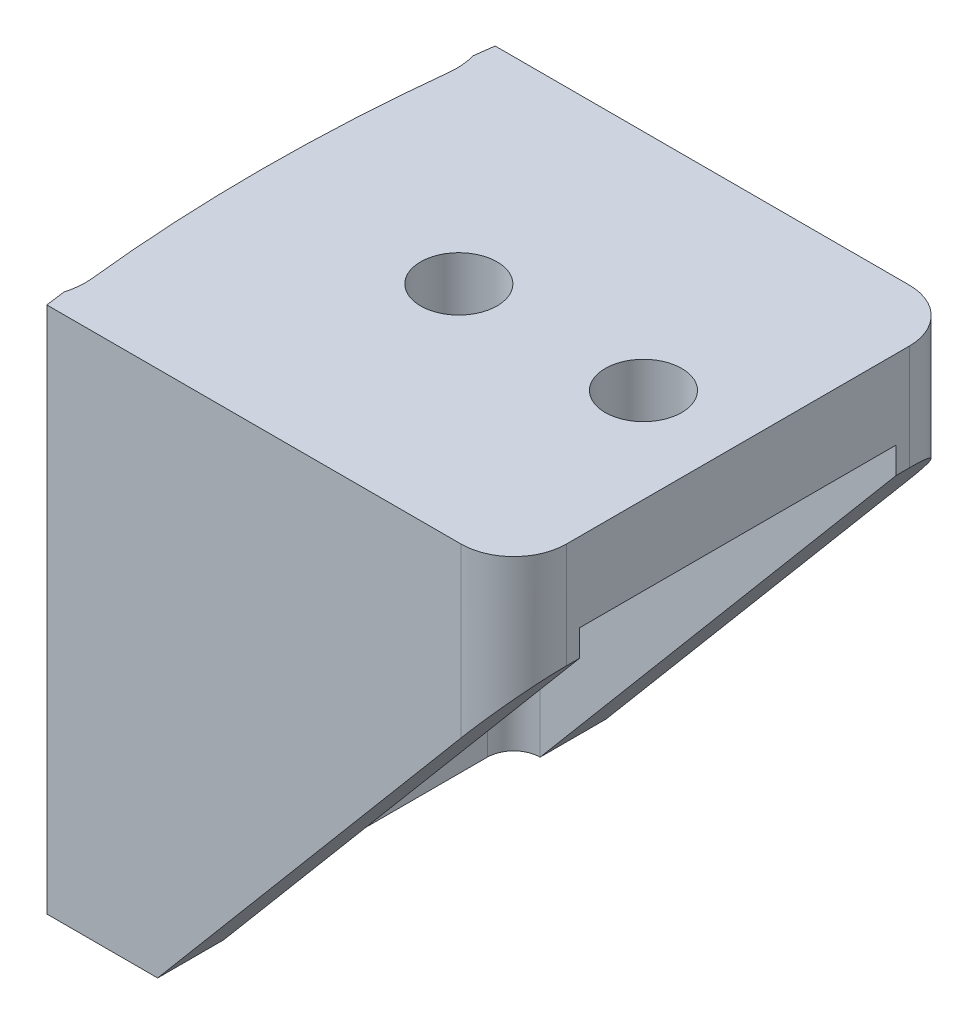
ISO-10303-21;
HEADER;
FILE_DESCRIPTION(('STEP AP214'),'2;1');
FILE_NAME('part.step','',(''),(''),'','','');
FILE_SCHEMA(('AUTOMOTIVE_DESIGN { 1 0 10303 214 1 1 1 1 }'));
ENDSEC;
DATA;
#1=APPLICATION_CONTEXT('core data for automotive mechanical design processes');
#2=APPLICATION_PROTOCOL_DEFINITION('international standard','automotive_design',2000,#1);
#3=PRODUCT_CONTEXT('',#1,'mechanical');
#4=PRODUCT('Part','Part','',(#3));
#5=PRODUCT_RELATED_PRODUCT_CATEGORY('part','',(#4));
#6=PRODUCT_DEFINITION_FORMATION('','',#4);
#7=PRODUCT_DEFINITION_CONTEXT('part definition',#1,'design');
#8=PRODUCT_DEFINITION('design','',#6,#7);
#9=PRODUCT_DEFINITION_SHAPE('','',#8);
#10=(LENGTH_UNIT() NAMED_UNIT(*) SI_UNIT(.MILLI.,.METRE.));
#11=(NAMED_UNIT(*) PLANE_ANGLE_UNIT() SI_UNIT($,.RADIAN.));
#12=(NAMED_UNIT(*) SI_UNIT($,.STERADIAN.) SOLID_ANGLE_UNIT());
#13=UNCERTAINTY_MEASURE_WITH_UNIT(LENGTH_MEASURE(1.E-05),#10,'distance_accuracy_value','');
#14=(GEOMETRIC_REPRESENTATION_CONTEXT(3) GLOBAL_UNCERTAINTY_ASSIGNED_CONTEXT((#13)) GLOBAL_UNIT_ASSIGNED_CONTEXT((#10,
#11,#12)) REPRESENTATION_CONTEXT('',''));
#15=CARTESIAN_POINT('',(0.,0.,0.));
#16=DIRECTION('',(0.,0.,1.));
#17=DIRECTION('',(1.,0.,0.));
#18=AXIS2_PLACEMENT_3D('',#15,#16,#17);
#19=CARTESIAN_POINT('',(-88.8386046433018,32.,-17.001));
#20=DIRECTION('',(-0.764291483507891,0.644870939209783,0.));
#21=DIRECTION('',(-0.644870939209783,-0.764291483507891,0.));
#22=AXIS2_PLACEMENT_3D('',#19,#20,#21);
#23=PLANE('',#22);
#24=DIRECTION('',(0.644870939209783,0.764291483507891,0.));
#25=VECTOR('',#24,1.);
#26=CARTESIAN_POINT('',(-88.8386046433018,32.,-17.));
#27=LINE('',#26,#25);
#28=CARTESIAN_POINT('',(-115.838604643302,0.,-17.));
#29=VERTEX_POINT('',#28);
#30=CARTESIAN_POINT('',(-92.8386046433018,27.2592592592593,-17.));
#31=VERTEX_POINT('',#30);
#32=EDGE_CURVE('E252',#29,#31,#27,.T.);
#33=ORIENTED_EDGE('',*,*,#32,.T.);
#34=CARTESIAN_POINT('',(-92.8386046433018,27.2592592592593,-13.));
#35=DIRECTION('',(-0.764291483507891,0.644870939209783,0.));
#36=DIRECTION('',(-0.644870939209783,-0.764291483507891,0.));
#37=AXIS2_PLACEMENT_3D('',#34,#35,#36);
#38=ELLIPSE('',#37,6.20279153050617,4.);
#39=CARTESIAN_POINT('',(-88.8386046433018,32.,-13.));
#40=VERTEX_POINT('',#39);
#41=EDGE_CURVE('E299',#31,#40,#38,.F.);
#42=ORIENTED_EDGE('',*,*,#41,.T.);
#43=DIRECTION('',(0.,0.,1.));
#44=VECTOR('',#43,1.);
#45=CARTESIAN_POINT('',(-88.8386046433018,32.,-17.001));
#46=LINE('',#45,#44);
#47=CARTESIAN_POINT('',(-88.8386046433018,32.,-12.));
#48=VERTEX_POINT('',#47);
#49=EDGE_CURVE('E228',#40,#48,#46,.T.);
#50=ORIENTED_EDGE('',*,*,#49,.T.);
#51=DIRECTION('',(-0.644870939209783,-0.764291483507891,0.));
#52=VECTOR('',#51,1.);
#53=CARTESIAN_POINT('',(-88.8386046433018,32.,-12.));
#54=LINE('',#53,#52);
#55=CARTESIAN_POINT('',(-115.838604643302,0.,-12.));
#56=VERTEX_POINT('',#55);
#57=EDGE_CURVE('E221',#48,#56,#54,.T.);
#58=ORIENTED_EDGE('',*,*,#57,.T.);
#59=DIRECTION('',(0.,0.,1.));
#60=VECTOR('',#59,1.);
#61=CARTESIAN_POINT('',(-115.838604643302,0.,-17.001));
#62=LINE('',#61,#60);
#63=EDGE_CURVE('E227',#29,#56,#62,.T.);
#64=ORIENTED_EDGE('',*,*,#63,.F.);
#65=EDGE_LOOP('',(#33,#42,#50,#58,#64));
#66=FACE_BOUND('',#65,.T.);
#67=ADVANCED_FACE('F39',(#66),#23,.F.);
#68=CARTESIAN_POINT('',(0.,40.,0.));
#69=DIRECTION('',(0.,-1.,0.));
#70=DIRECTION('',(0.,0.,-1.));
#71=AXIS2_PLACEMENT_3D('',#68,#69,#70);
#72=CYLINDRICAL_SURFACE('',#71,125.);
#73=CARTESIAN_POINT('',(0.,0.,0.));
#74=DIRECTION('',(0.,1.,0.));
#75=DIRECTION('',(0.,0.,1.));
#76=AXIS2_PLACEMENT_3D('',#73,#74,#75);
#77=CIRCLE('',#76,125.);
#78=CARTESIAN_POINT('',(-124.263961042821,0.,-13.5450354723926));
#79=VERTEX_POINT('',#78);
#80=CARTESIAN_POINT('',(-124.263961042821,0.,13.5450354723919));
#81=VERTEX_POINT('',#80);
#82=EDGE_CURVE('E258',#79,#81,#77,.T.);
#83=ORIENTED_EDGE('',*,*,#82,.T.);
#84=DIRECTION('',(0.,-1.,0.));
#85=VECTOR('',#84,1.);
#86=CARTESIAN_POINT('',(-124.263961042821,40.,13.5450354723919));
#87=LINE('',#86,#85);
#88=CARTESIAN_POINT('',(-124.263961042821,40.,13.5450354723919));
#89=VERTEX_POINT('',#88);
#90=EDGE_CURVE('E185',#81,#89,#87,.F.);
#91=ORIENTED_EDGE('',*,*,#90,.T.);
#92=CARTESIAN_POINT('',(0.,40.,0.));
#93=DIRECTION('',(0.,1.,0.));
#94=DIRECTION('',(0.,0.,1.));
#95=AXIS2_PLACEMENT_3D('',#92,#93,#94);
#96=CIRCLE('',#95,125.);
#97=CARTESIAN_POINT('',(-124.263961042821,40.,-13.5450354723926));
#98=VERTEX_POINT('',#97);
#99=EDGE_CURVE('E260',#98,#89,#96,.T.);
#100=ORIENTED_EDGE('',*,*,#99,.F.);
#101=DIRECTION('',(0.,-1.,0.));
#102=VECTOR('',#101,1.);
#103=CARTESIAN_POINT('',(-124.263961042821,40.,-13.5450354723926));
#104=LINE('',#103,#102);
#105=EDGE_CURVE('E301',#98,#79,#104,.T.);
#106=ORIENTED_EDGE('',*,*,#105,.T.);
#107=EDGE_LOOP('',(#83,#91,#100,#106));
#108=FACE_BOUND('',#107,.T.);
#109=ADVANCED_FACE('F304',(#108),#72,.T.);
#110=CARTESIAN_POINT('',(-88.8386046433018,40.,17.));
#111=DIRECTION('',(0.,0.,-1.));
#112=DIRECTION('',(-1.,0.,0.));
#113=AXIS2_PLACEMENT_3D('',#110,#111,#112);
#114=PLANE('',#113);
#115=DIRECTION('',(-0.644870939209783,-0.764291483507891,0.));
#116=VECTOR('',#115,1.);
#117=CARTESIAN_POINT('',(-88.8386046433018,32.,17.));
#118=LINE('',#117,#116);
#119=CARTESIAN_POINT('',(-92.8386046433018,27.2592592592593,17.));
#120=VERTEX_POINT('',#119);
#121=CARTESIAN_POINT('',(-115.838604643302,0.,17.));
#122=VERTEX_POINT('',#121);
#123=EDGE_CURVE('E226',#120,#122,#118,.T.);
#124=ORIENTED_EDGE('',*,*,#123,.F.);
#125=DIRECTION('',(0.,-1.,0.));
#126=VECTOR('',#125,1.);
#127=CARTESIAN_POINT('',(-92.8386046433018,40.,17.));
#128=LINE('',#127,#126);
#129=CARTESIAN_POINT('',(-92.8386046433018,40.,17.));
#130=VERTEX_POINT('',#129);
#131=EDGE_CURVE('E290',#120,#130,#128,.F.);
#132=ORIENTED_EDGE('',*,*,#131,.T.);
#133=DIRECTION('',(1.,0.,0.));
#134=VECTOR('',#133,1.);
#135=CARTESIAN_POINT('',(-88.8386046433018,40.,17.));
#136=LINE('',#135,#134);
#137=CARTESIAN_POINT('',(-124.242343828503,40.,17.));
#138=VERTEX_POINT('',#137);
#139=EDGE_CURVE('E263',#138,#130,#136,.T.);
#140=ORIENTED_EDGE('',*,*,#139,.F.);
#141=DIRECTION('',(0.,1.,0.));
#142=VECTOR('',#141,1.);
#143=CARTESIAN_POINT('',(-124.242343828503,0.,17.));
#144=LINE('',#143,#142);
#145=CARTESIAN_POINT('',(-124.242343828503,0.,17.));
#146=VERTEX_POINT('',#145);
#147=EDGE_CURVE('E169',#146,#138,#144,.T.);
#148=ORIENTED_EDGE('',*,*,#147,.F.);
#149=DIRECTION('',(1.,0.,0.));
#150=VECTOR('',#149,1.);
#151=CARTESIAN_POINT('',(-88.8386046433018,0.,17.));
#152=LINE('',#151,#150);
#153=EDGE_CURVE('E179',#146,#122,#152,.T.);
#154=ORIENTED_EDGE('',*,*,#153,.T.);
#155=EDGE_LOOP('',(#124,#132,#140,#148,#154));
#156=FACE_BOUND('',#155,.T.);
#157=ADVANCED_FACE('F342',(#156),#114,.F.);
#158=CARTESIAN_POINT('',(-88.8386046433018,40.,-17.));
#159=DIRECTION('',(-1.,0.,0.));
#160=DIRECTION('',(0.,0.,1.));
#161=AXIS2_PLACEMENT_3D('',#158,#159,#160);
#162=PLANE('',#161);
#163=DIRECTION('',(0.,0.,-1.));
#164=VECTOR('',#163,1.);
#165=CARTESIAN_POINT('',(-88.8386046433018,40.,-17.));
#166=LINE('',#165,#164);
#167=CARTESIAN_POINT('',(-88.8386046433018,40.,13.));
#168=VERTEX_POINT('',#167);
#169=CARTESIAN_POINT('',(-88.8386046433018,40.,-13.));
#170=VERTEX_POINT('',#169);
#171=EDGE_CURVE('E267',#168,#170,#166,.T.);
#172=ORIENTED_EDGE('',*,*,#171,.F.);
#173=DIRECTION('',(0.,-1.,0.));
#174=VECTOR('',#173,1.);
#175=CARTESIAN_POINT('',(-88.8386046433018,40.,13.));
#176=LINE('',#175,#174);
#177=CARTESIAN_POINT('',(-88.8386046433018,32.,13.));
#178=VERTEX_POINT('',#177);
#179=EDGE_CURVE('E285',#168,#178,#176,.T.);
#180=ORIENTED_EDGE('',*,*,#179,.T.);
#181=CARTESIAN_POINT('',(-88.8386046433018,32.,12.));
#182=VERTEX_POINT('',#181);
#183=EDGE_CURVE('E256',#182,#178,#46,.T.);
#184=ORIENTED_EDGE('',*,*,#183,.F.);
#185=DIRECTION('',(0.,-1.,0.));
#186=VECTOR('',#185,1.);
#187=CARTESIAN_POINT('',(-88.8386046433018,34.,12.));
#188=LINE('',#187,#186);
#189=CARTESIAN_POINT('',(-88.8386046433018,34.,12.));
#190=VERTEX_POINT('',#189);
#191=EDGE_CURVE('E217',#190,#182,#188,.T.);
#192=ORIENTED_EDGE('',*,*,#191,.F.);
#193=DIRECTION('',(0.,0.,1.));
#194=VECTOR('',#193,1.);
#195=CARTESIAN_POINT('',(-88.8386046433018,34.,-12.));
#196=LINE('',#195,#194);
#197=CARTESIAN_POINT('',(-88.8386046433018,34.,-12.));
#198=VERTEX_POINT('',#197);
#199=EDGE_CURVE('E243',#198,#190,#196,.T.);
#200=ORIENTED_EDGE('',*,*,#199,.F.);
#201=DIRECTION('',(0.,-1.,0.));
#202=VECTOR('',#201,1.);
#203=CARTESIAN_POINT('',(-88.8386046433018,34.,-12.));
#204=LINE('',#203,#202);
#205=EDGE_CURVE('E249',#198,#48,#204,.T.);
#206=ORIENTED_EDGE('',*,*,#205,.T.);
#207=ORIENTED_EDGE('',*,*,#49,.F.);
#208=DIRECTION('',(0.,-1.,0.));
#209=VECTOR('',#208,1.);
#210=CARTESIAN_POINT('',(-88.8386046433018,40.,-13.));
#211=LINE('',#210,#209);
#212=EDGE_CURVE('E276',#40,#170,#211,.F.);
#213=ORIENTED_EDGE('',*,*,#212,.T.);
#214=EDGE_LOOP('',(#172,#180,#184,#192,#200,#206,#207,#213));
#215=FACE_BOUND('',#214,.T.);
#216=ADVANCED_FACE('F337',(#215),#162,.F.);
#217=CARTESIAN_POINT('',(-123.838604643302,40.,-17.));
#218=DIRECTION('',(0.,0.,1.));
#219=DIRECTION('',(1.,0.,0.));
#220=AXIS2_PLACEMENT_3D('',#217,#218,#219);
#221=PLANE('',#220);
#222=DIRECTION('',(-1.,0.,0.));
#223=VECTOR('',#222,1.);
#224=CARTESIAN_POINT('',(-123.838604643302,40.,-17.));
#225=LINE('',#224,#223);
#226=CARTESIAN_POINT('',(-92.8386046433018,40.,-17.));
#227=VERTEX_POINT('',#226);
#228=CARTESIAN_POINT('',(-124.242343828503,40.,-17.));
#229=VERTEX_POINT('',#228);
#230=EDGE_CURVE('E222',#227,#229,#225,.T.);
#231=ORIENTED_EDGE('',*,*,#230,.F.);
#232=DIRECTION('',(0.,-1.,0.));
#233=VECTOR('',#232,1.);
#234=CARTESIAN_POINT('',(-92.8386046433018,40.,-17.));
#235=LINE('',#234,#233);
#236=EDGE_CURVE('E296',#227,#31,#235,.T.);
#237=ORIENTED_EDGE('',*,*,#236,.T.);
#238=ORIENTED_EDGE('',*,*,#32,.F.);
#239=DIRECTION('',(-1.,0.,0.));
#240=VECTOR('',#239,1.);
#241=CARTESIAN_POINT('',(-123.838604643302,0.,-17.));
#242=LINE('',#241,#240);
#243=CARTESIAN_POINT('',(-124.242343828503,0.,-17.));
#244=VERTEX_POINT('',#243);
#245=EDGE_CURVE('E264',#29,#244,#242,.T.);
#246=ORIENTED_EDGE('',*,*,#245,.T.);
#247=DIRECTION('',(0.,1.,0.));
#248=VECTOR('',#247,1.);
#249=CARTESIAN_POINT('',(-124.242343828503,0.,-17.));
#250=LINE('',#249,#248);
#251=EDGE_CURVE('E323',#244,#229,#250,.T.);
#252=ORIENTED_EDGE('',*,*,#251,.T.);
#253=EDGE_LOOP('',(#231,#237,#238,#246,#252));
#254=FACE_BOUND('',#253,.T.);
#255=ADVANCED_FACE('F353',(#254),#221,.F.);
#256=CARTESIAN_POINT('',(0.,40.,0.));
#257=DIRECTION('',(0.,1.,0.));
#258=DIRECTION('',(0.,0.,1.));
#259=AXIS2_PLACEMENT_3D('',#256,#257,#258);
#260=PLANE('',#259);
#261=CARTESIAN_POINT('',(-96.,40.,0.));
#262=DIRECTION('',(0.,1.,0.));
#263=DIRECTION('',(0.,0.,1.));
#264=AXIS2_PLACEMENT_3D('',#261,#262,#263);
#265=CIRCLE('',#264,2.9);
#266=CARTESIAN_POINT('',(-96.,40.,2.9));
#267=VERTEX_POINT('',#266);
#268=EDGE_CURVE('E283',#267,#267,#265,.T.);
#269=ORIENTED_EDGE('',*,*,#268,.F.);
#270=EDGE_LOOP('',(#269));
#271=FACE_BOUND('',#270,.T.);
#272=CARTESIAN_POINT('',(-110.,40.,0.));
#273=DIRECTION('',(0.,1.,0.));
#274=DIRECTION('',(0.,0.,1.));
#275=AXIS2_PLACEMENT_3D('',#272,#273,#274);
#276=CIRCLE('',#275,2.9);
#277=CARTESIAN_POINT('',(-110.,40.,2.9));
#278=VERTEX_POINT('',#277);
#279=EDGE_CURVE('E279',#278,#278,#276,.T.);
#280=ORIENTED_EDGE('',*,*,#279,.F.);
#281=EDGE_LOOP('',(#280));
#282=FACE_BOUND('',#281,.T.);
#283=ORIENTED_EDGE('',*,*,#139,.T.);
#284=CARTESIAN_POINT('',(-92.8386046433018,40.,13.));
#285=DIRECTION('',(0.,1.,0.));
#286=DIRECTION('',(0.,0.,1.));
#287=AXIS2_PLACEMENT_3D('',#284,#285,#286);
#288=CIRCLE('',#287,4.);
#289=EDGE_CURVE('E294',#130,#168,#288,.T.);
#290=ORIENTED_EDGE('',*,*,#289,.T.);
#291=ORIENTED_EDGE('',*,*,#171,.T.);
#292=CARTESIAN_POINT('',(-92.8386046433018,40.,-13.));
#293=DIRECTION('',(0.,1.,0.));
#294=DIRECTION('',(0.,0.,1.));
#295=AXIS2_PLACEMENT_3D('',#292,#293,#294);
#296=CIRCLE('',#295,4.);
#297=EDGE_CURVE('E292',#170,#227,#296,.T.);
#298=ORIENTED_EDGE('',*,*,#297,.T.);
#299=ORIENTED_EDGE('',*,*,#230,.T.);
#300=CARTESIAN_POINT('',(0.,40.,0.));
#301=DIRECTION('',(0.,1.,0.));
#302=DIRECTION('',(0.,0.,1.));
#303=AXIS2_PLACEMENT_3D('',#300,#301,#302);
#304=CIRCLE('',#303,125.4);
#305=CARTESIAN_POINT('',(-124.438378324374,40.,-15.5000000000001));
#306=VERTEX_POINT('',#305);
#307=EDGE_CURVE('E310',#229,#306,#304,.T.);
#308=ORIENTED_EDGE('',*,*,#307,.T.);
#309=CARTESIAN_POINT('',(-129.234519484533,40.,-14.0868368912883));
#310=DIRECTION('',(0.,1.,0.));
#311=DIRECTION('',(0.,0.,1.));
#312=AXIS2_PLACEMENT_3D('',#309,#310,#311);
#313=CIRCLE('',#312,5.);
#314=EDGE_CURVE('E186',#306,#98,#313,.F.);
#315=ORIENTED_EDGE('',*,*,#314,.T.);
#316=ORIENTED_EDGE('',*,*,#99,.T.);
#317=CARTESIAN_POINT('',(-129.234519484533,40.,14.0868368912876));
#318=DIRECTION('',(0.,1.,0.));
#319=DIRECTION('',(0.,0.,1.));
#320=AXIS2_PLACEMENT_3D('',#317,#318,#319);
#321=CIRCLE('',#320,5.);
#322=CARTESIAN_POINT('',(-124.438378324374,40.,15.5000000000001));
#323=VERTEX_POINT('',#322);
#324=EDGE_CURVE('E187',#89,#323,#321,.F.);
#325=ORIENTED_EDGE('',*,*,#324,.T.);
#326=CARTESIAN_POINT('',(0.,40.,0.));
#327=DIRECTION('',(0.,1.,0.));
#328=DIRECTION('',(0.,0.,-1.));
#329=AXIS2_PLACEMENT_3D('',#326,#327,#328);
#330=CIRCLE('',#329,125.4);
#331=EDGE_CURVE('E166',#323,#138,#330,.T.);
#332=ORIENTED_EDGE('',*,*,#331,.T.);
#333=EDGE_LOOP('',(#283,#290,#291,#298,#299,#308,#315,#316,#325,#332));
#334=FACE_BOUND('',#333,.T.);
#335=ADVANCED_FACE('F307',(#271,#282,#334),#260,.T.);
#336=CARTESIAN_POINT('',(0.,0.,0.));
#337=DIRECTION('',(0.,1.,0.));
#338=DIRECTION('',(0.,0.,1.));
#339=AXIS2_PLACEMENT_3D('',#336,#337,#338);
#340=PLANE('',#339);
#341=ORIENTED_EDGE('',*,*,#63,.T.);
#342=CARTESIAN_POINT('',(-115.838604643302,0.,-10.));
#343=DIRECTION('',(0.,1.,0.));
#344=DIRECTION('',(0.,0.,1.));
#345=AXIS2_PLACEMENT_3D('',#342,#343,#344);
#346=CIRCLE('',#345,2.);
#347=CARTESIAN_POINT('',(-117.838604643302,0.,-10.));
#348=VERTEX_POINT('',#347);
#349=EDGE_CURVE('E11',#56,#348,#346,.T.);
#350=ORIENTED_EDGE('',*,*,#349,.T.);
#351=DIRECTION('',(0.,0.,-1.));
#352=VECTOR('',#351,1.);
#353=CARTESIAN_POINT('',(-117.838604643302,0.,-12.));
#354=LINE('',#353,#352);
#355=CARTESIAN_POINT('',(-117.838604643302,0.,10.));
#356=VERTEX_POINT('',#355);
#357=EDGE_CURVE('E210',#356,#348,#354,.T.);
#358=ORIENTED_EDGE('',*,*,#357,.F.);
#359=CARTESIAN_POINT('',(-115.838604643302,0.,10.));
#360=DIRECTION('',(0.,1.,0.));
#361=DIRECTION('',(0.,0.,1.));
#362=AXIS2_PLACEMENT_3D('',#359,#360,#361);
#363=CIRCLE('',#362,2.);
#364=CARTESIAN_POINT('',(-115.838604643302,0.,12.));
#365=VERTEX_POINT('',#364);
#366=EDGE_CURVE('E47',#356,#365,#363,.T.);
#367=ORIENTED_EDGE('',*,*,#366,.T.);
#368=EDGE_CURVE('E208',#365,#122,#62,.T.);
#369=ORIENTED_EDGE('',*,*,#368,.T.);
#370=ORIENTED_EDGE('',*,*,#153,.F.);
#371=CARTESIAN_POINT('',(0.,0.,0.));
#372=DIRECTION('',(0.,1.,0.));
#373=DIRECTION('',(0.,0.,-1.));
#374=AXIS2_PLACEMENT_3D('',#371,#372,#373);
#375=CIRCLE('',#374,125.4);
#376=CARTESIAN_POINT('',(-124.438378324374,0.,15.5000000000001));
#377=VERTEX_POINT('',#376);
#378=EDGE_CURVE('E164',#377,#146,#375,.T.);
#379=ORIENTED_EDGE('',*,*,#378,.F.);
#380=CARTESIAN_POINT('',(-129.234519484533,0.,14.0868368912876));
#381=DIRECTION('',(0.,1.,0.));
#382=DIRECTION('',(0.,0.,1.));
#383=AXIS2_PLACEMENT_3D('',#380,#381,#382);
#384=CIRCLE('',#383,5.);
#385=EDGE_CURVE('E175',#377,#81,#384,.T.);
#386=ORIENTED_EDGE('',*,*,#385,.T.);
#387=ORIENTED_EDGE('',*,*,#82,.F.);
#388=CARTESIAN_POINT('',(-129.234519484533,0.,-14.0868368912883));
#389=DIRECTION('',(0.,1.,0.));
#390=DIRECTION('',(0.,0.,1.));
#391=AXIS2_PLACEMENT_3D('',#388,#389,#390);
#392=CIRCLE('',#391,5.);
#393=CARTESIAN_POINT('',(-124.438378324374,0.,-15.5000000000001));
#394=VERTEX_POINT('',#393);
#395=EDGE_CURVE('E189',#79,#394,#392,.T.);
#396=ORIENTED_EDGE('',*,*,#395,.T.);
#397=CARTESIAN_POINT('',(0.,0.,0.));
#398=DIRECTION('',(0.,1.,0.));
#399=DIRECTION('',(0.,0.,1.));
#400=AXIS2_PLACEMENT_3D('',#397,#398,#399);
#401=CIRCLE('',#400,125.4);
#402=EDGE_CURVE('E322',#244,#394,#401,.T.);
#403=ORIENTED_EDGE('',*,*,#402,.F.);
#404=ORIENTED_EDGE('',*,*,#245,.F.);
#405=EDGE_LOOP('',(#341,#350,#358,#367,#369,#370,#379,#386,#387,#396,#403,#404));
#406=FACE_BOUND('',#405,.T.);
#407=ADVANCED_FACE('F173',(#406),#340,.F.);
#408=ORIENTED_EDGE('',*,*,#183,.T.);
#409=CARTESIAN_POINT('',(-92.8386046433018,27.2592592592593,13.));
#410=DIRECTION('',(-0.764291483507891,0.644870939209783,0.));
#411=DIRECTION('',(-0.644870939209783,-0.764291483507891,0.));
#412=AXIS2_PLACEMENT_3D('',#409,#410,#411);
#413=ELLIPSE('',#412,6.20279153050617,4.);
#414=EDGE_CURVE('E288',#178,#120,#413,.F.);
#415=ORIENTED_EDGE('',*,*,#414,.T.);
#416=ORIENTED_EDGE('',*,*,#123,.T.);
#417=ORIENTED_EDGE('',*,*,#368,.F.);
#418=DIRECTION('',(0.644870939209783,0.764291483507891,0.));
#419=VECTOR('',#418,1.);
#420=CARTESIAN_POINT('',(-88.8386046433018,32.,12.));
#421=LINE('',#420,#419);
#422=EDGE_CURVE('E214',#365,#182,#421,.T.);
#423=ORIENTED_EDGE('',*,*,#422,.T.);
#424=EDGE_LOOP('',(#408,#415,#416,#417,#423));
#425=FACE_BOUND('',#424,.T.);
#426=ADVANCED_FACE('F224',(#425),#23,.F.);
#427=CARTESIAN_POINT('',(-117.838604643302,34.,-12.));
#428=DIRECTION('',(0.,0.,-1.));
#429=DIRECTION('',(-1.,0.,0.));
#430=AXIS2_PLACEMENT_3D('',#427,#428,#429);
#431=PLANE('',#430);
#432=DIRECTION('',(1.,0.,0.));
#433=VECTOR('',#432,1.);
#434=CARTESIAN_POINT('',(-117.838604643302,34.,-12.));
#435=LINE('',#434,#433);
#436=CARTESIAN_POINT('',(-115.838604643302,34.,-12.));
#437=VERTEX_POINT('',#436);
#438=EDGE_CURVE('E240',#437,#198,#435,.T.);
#439=ORIENTED_EDGE('',*,*,#438,.F.);
#440=DIRECTION('',(0.,-1.,0.));
#441=VECTOR('',#440,1.);
#442=CARTESIAN_POINT('',(-115.838604643302,0.,-12.));
#443=LINE('',#442,#441);
#444=EDGE_CURVE('E204',#437,#56,#443,.T.);
#445=ORIENTED_EDGE('',*,*,#444,.T.);
#446=ORIENTED_EDGE('',*,*,#57,.F.);
#447=ORIENTED_EDGE('',*,*,#205,.F.);
#448=EDGE_LOOP('',(#439,#445,#446,#447));
#449=FACE_BOUND('',#448,.T.);
#450=ADVANCED_FACE('F361',(#449),#431,.F.);
#451=CARTESIAN_POINT('',(-117.838604643302,34.,12.));
#452=DIRECTION('',(0.,0.,1.));
#453=DIRECTION('',(1.,0.,0.));
#454=AXIS2_PLACEMENT_3D('',#451,#452,#453);
#455=PLANE('',#454);
#456=ORIENTED_EDGE('',*,*,#422,.F.);
#457=DIRECTION('',(0.,-1.,0.));
#458=VECTOR('',#457,1.);
#459=CARTESIAN_POINT('',(-115.838604643302,34.,12.));
#460=LINE('',#459,#458);
#461=CARTESIAN_POINT('',(-115.838604643302,34.,12.));
#462=VERTEX_POINT('',#461);
#463=EDGE_CURVE('E62',#365,#462,#460,.F.);
#464=ORIENTED_EDGE('',*,*,#463,.T.);
#465=DIRECTION('',(-1.,0.,0.));
#466=VECTOR('',#465,1.);
#467=CARTESIAN_POINT('',(-117.838604643302,34.,12.));
#468=LINE('',#467,#466);
#469=EDGE_CURVE('E236',#190,#462,#468,.T.);
#470=ORIENTED_EDGE('',*,*,#469,.F.);
#471=ORIENTED_EDGE('',*,*,#191,.T.);
#472=EDGE_LOOP('',(#456,#464,#470,#471));
#473=FACE_BOUND('',#472,.T.);
#474=ADVANCED_FACE('F215',(#473),#455,.F.);
#475=CARTESIAN_POINT('',(-117.838604643302,34.,-12.));
#476=DIRECTION('',(-1.,0.,0.));
#477=DIRECTION('',(0.,0.,1.));
#478=AXIS2_PLACEMENT_3D('',#475,#476,#477);
#479=PLANE('',#478);
#480=DIRECTION('',(0.,0.,-1.));
#481=VECTOR('',#480,1.);
#482=CARTESIAN_POINT('',(-117.838604643302,34.,-12.));
#483=LINE('',#482,#481);
#484=CARTESIAN_POINT('',(-117.838604643302,34.,10.));
#485=VERTEX_POINT('',#484);
#486=CARTESIAN_POINT('',(-117.838604643302,34.,-10.));
#487=VERTEX_POINT('',#486);
#488=EDGE_CURVE('E234',#485,#487,#483,.T.);
#489=ORIENTED_EDGE('',*,*,#488,.F.);
#490=DIRECTION('',(0.,-1.,0.));
#491=VECTOR('',#490,1.);
#492=CARTESIAN_POINT('',(-117.838604643302,0.,10.));
#493=LINE('',#492,#491);
#494=EDGE_CURVE('E197',#485,#356,#493,.T.);
#495=ORIENTED_EDGE('',*,*,#494,.T.);
#496=ORIENTED_EDGE('',*,*,#357,.T.);
#497=DIRECTION('',(0.,-1.,0.));
#498=VECTOR('',#497,1.);
#499=CARTESIAN_POINT('',(-117.838604643302,34.,-10.));
#500=LINE('',#499,#498);
#501=EDGE_CURVE('E195',#348,#487,#500,.F.);
#502=ORIENTED_EDGE('',*,*,#501,.T.);
#503=EDGE_LOOP('',(#489,#495,#496,#502));
#504=FACE_BOUND('',#503,.T.);
#505=ADVANCED_FACE('F238',(#504),#479,.F.);
#506=CARTESIAN_POINT('',(0.,34.,0.));
#507=DIRECTION('',(0.,1.,0.));
#508=DIRECTION('',(0.,0.,1.));
#509=AXIS2_PLACEMENT_3D('',#506,#507,#508);
#510=PLANE('',#509);
#511=CARTESIAN_POINT('',(-96.,34.,0.));
#512=DIRECTION('',(0.,1.,0.));
#513=DIRECTION('',(0.,0.,1.));
#514=AXIS2_PLACEMENT_3D('',#511,#512,#513);
#515=CIRCLE('',#514,2.9);
#516=CARTESIAN_POINT('',(-96.,34.,2.9));
#517=VERTEX_POINT('',#516);
#518=EDGE_CURVE('E280',#517,#517,#515,.T.);
#519=ORIENTED_EDGE('',*,*,#518,.T.);
#520=EDGE_LOOP('',(#519));
#521=FACE_BOUND('',#520,.T.);
#522=CARTESIAN_POINT('',(-110.,34.,0.));
#523=DIRECTION('',(0.,1.,0.));
#524=DIRECTION('',(0.,0.,1.));
#525=AXIS2_PLACEMENT_3D('',#522,#523,#524);
#526=CIRCLE('',#525,2.9);
#527=CARTESIAN_POINT('',(-110.,34.,2.9));
#528=VERTEX_POINT('',#527);
#529=EDGE_CURVE('E248',#528,#528,#526,.T.);
#530=ORIENTED_EDGE('',*,*,#529,.T.);
#531=EDGE_LOOP('',(#530));
#532=FACE_BOUND('',#531,.T.);
#533=ORIENTED_EDGE('',*,*,#469,.T.);
#534=CARTESIAN_POINT('',(-115.838604643302,34.,10.));
#535=DIRECTION('',(0.,1.,0.));
#536=DIRECTION('',(0.,0.,1.));
#537=AXIS2_PLACEMENT_3D('',#534,#535,#536);
#538=CIRCLE('',#537,2.);
#539=EDGE_CURVE('E202',#462,#485,#538,.F.);
#540=ORIENTED_EDGE('',*,*,#539,.T.);
#541=ORIENTED_EDGE('',*,*,#488,.T.);
#542=CARTESIAN_POINT('',(-115.838604643302,34.,-10.));
#543=DIRECTION('',(0.,1.,0.));
#544=DIRECTION('',(0.,0.,1.));
#545=AXIS2_PLACEMENT_3D('',#542,#543,#544);
#546=CIRCLE('',#545,2.);
#547=EDGE_CURVE('E54',#487,#437,#546,.F.);
#548=ORIENTED_EDGE('',*,*,#547,.T.);
#549=ORIENTED_EDGE('',*,*,#438,.T.);
#550=ORIENTED_EDGE('',*,*,#199,.T.);
#551=EDGE_LOOP('',(#533,#540,#541,#548,#549,#550));
#552=FACE_BOUND('',#551,.T.);
#553=ADVANCED_FACE('F233',(#521,#532,#552),#510,.F.);
#554=CARTESIAN_POINT('',(-110.,9.,0.));
#555=DIRECTION('',(0.,1.,0.));
#556=DIRECTION('',(0.,0.,1.));
#557=AXIS2_PLACEMENT_3D('',#554,#555,#556);
#558=CYLINDRICAL_SURFACE('',#557,2.9);
#559=ORIENTED_EDGE('',*,*,#279,.T.);
#560=EDGE_LOOP('',(#559));
#561=FACE_BOUND('',#560,.T.);
#562=ORIENTED_EDGE('',*,*,#529,.F.);
#563=EDGE_LOOP('',(#562));
#564=FACE_BOUND('',#563,.T.);
#565=ADVANCED_FACE('F424',(#561,#564),#558,.F.);
#566=CARTESIAN_POINT('',(-96.,9.,0.));
#567=DIRECTION('',(0.,1.,0.));
#568=DIRECTION('',(0.,0.,1.));
#569=AXIS2_PLACEMENT_3D('',#566,#567,#568);
#570=CYLINDRICAL_SURFACE('',#569,2.9);
#571=ORIENTED_EDGE('',*,*,#268,.T.);
#572=EDGE_LOOP('',(#571));
#573=FACE_BOUND('',#572,.T.);
#574=ORIENTED_EDGE('',*,*,#518,.F.);
#575=EDGE_LOOP('',(#574));
#576=FACE_BOUND('',#575,.T.);
#577=ADVANCED_FACE('F396',(#573,#576),#570,.F.);
#578=CARTESIAN_POINT('',(-92.8386046433018,40.,13.));
#579=DIRECTION('',(0.,-1.,0.));
#580=DIRECTION('',(0.,0.,-1.));
#581=AXIS2_PLACEMENT_3D('',#578,#579,#580);
#582=CYLINDRICAL_SURFACE('',#581,4.);
#583=ORIENTED_EDGE('',*,*,#289,.F.);
#584=ORIENTED_EDGE('',*,*,#131,.F.);
#585=ORIENTED_EDGE('',*,*,#414,.F.);
#586=ORIENTED_EDGE('',*,*,#179,.F.);
#587=EDGE_LOOP('',(#583,#584,#585,#586));
#588=FACE_BOUND('',#587,.T.);
#589=ADVANCED_FACE('F344',(#588),#582,.T.);
#590=CARTESIAN_POINT('',(-92.8386046433018,40.,-13.));
#591=DIRECTION('',(0.,-1.,0.));
#592=DIRECTION('',(0.,0.,-1.));
#593=AXIS2_PLACEMENT_3D('',#590,#591,#592);
#594=CYLINDRICAL_SURFACE('',#593,4.);
#595=ORIENTED_EDGE('',*,*,#297,.F.);
#596=ORIENTED_EDGE('',*,*,#212,.F.);
#597=ORIENTED_EDGE('',*,*,#41,.F.);
#598=ORIENTED_EDGE('',*,*,#236,.F.);
#599=EDGE_LOOP('',(#595,#596,#597,#598));
#600=FACE_BOUND('',#599,.T.);
#601=ADVANCED_FACE('F349',(#600),#594,.T.);
#602=CARTESIAN_POINT('',(0.,0.,0.));
#603=DIRECTION('',(0.,1.,0.));
#604=DIRECTION('',(0.,0.,1.));
#605=AXIS2_PLACEMENT_3D('',#602,#603,#604);
#606=CYLINDRICAL_SURFACE('',#605,125.4);
#607=ORIENTED_EDGE('',*,*,#307,.F.);
#608=ORIENTED_EDGE('',*,*,#251,.F.);
#609=ORIENTED_EDGE('',*,*,#402,.T.);
#610=DIRECTION('',(0.,1.,0.));
#611=VECTOR('',#610,1.);
#612=CARTESIAN_POINT('',(-124.438378324374,0.,-15.5000000000001));
#613=LINE('',#612,#611);
#614=EDGE_CURVE('E316',#394,#306,#613,.T.);
#615=ORIENTED_EDGE('',*,*,#614,.T.);
#616=EDGE_LOOP('',(#607,#608,#609,#615));
#617=FACE_BOUND('',#616,.T.);
#618=ADVANCED_FACE('F319',(#617),#606,.T.);
#619=CARTESIAN_POINT('',(0.,0.,0.));
#620=DIRECTION('',(0.,1.,0.));
#621=DIRECTION('',(0.,0.,1.));
#622=AXIS2_PLACEMENT_3D('',#619,#620,#621);
#623=CYLINDRICAL_SURFACE('',#622,125.4);
#624=ORIENTED_EDGE('',*,*,#331,.F.);
#625=DIRECTION('',(0.,1.,0.));
#626=VECTOR('',#625,1.);
#627=CARTESIAN_POINT('',(-124.438378324374,0.,15.5000000000001));
#628=LINE('',#627,#626);
#629=EDGE_CURVE('E160',#377,#323,#628,.T.);
#630=ORIENTED_EDGE('',*,*,#629,.F.);
#631=ORIENTED_EDGE('',*,*,#378,.T.);
#632=ORIENTED_EDGE('',*,*,#147,.T.);
#633=EDGE_LOOP('',(#624,#630,#631,#632));
#634=FACE_BOUND('',#633,.T.);
#635=ADVANCED_FACE('F162',(#634),#623,.T.);
#636=CARTESIAN_POINT('',(-129.234519484533,0.,14.0868368912876));
#637=DIRECTION('',(0.,-1.,0.));
#638=DIRECTION('',(0.,0.,-1.));
#639=AXIS2_PLACEMENT_3D('',#636,#637,#638);
#640=CYLINDRICAL_SURFACE('',#639,5.);
#641=ORIENTED_EDGE('',*,*,#385,.F.);
#642=ORIENTED_EDGE('',*,*,#629,.T.);
#643=ORIENTED_EDGE('',*,*,#324,.F.);
#644=ORIENTED_EDGE('',*,*,#90,.F.);
#645=EDGE_LOOP('',(#641,#642,#643,#644));
#646=FACE_BOUND('',#645,.T.);
#647=ADVANCED_FACE('F183',(#646),#640,.F.);
#648=CARTESIAN_POINT('',(-129.234519484533,40.,-14.0868368912883));
#649=DIRECTION('',(0.,-1.,0.));
#650=DIRECTION('',(0.,0.,-1.));
#651=AXIS2_PLACEMENT_3D('',#648,#649,#650);
#652=CYLINDRICAL_SURFACE('',#651,5.);
#653=ORIENTED_EDGE('',*,*,#395,.F.);
#654=ORIENTED_EDGE('',*,*,#105,.F.);
#655=ORIENTED_EDGE('',*,*,#314,.F.);
#656=ORIENTED_EDGE('',*,*,#614,.F.);
#657=EDGE_LOOP('',(#653,#654,#655,#656));
#658=FACE_BOUND('',#657,.T.);
#659=ADVANCED_FACE('F315',(#658),#652,.F.);
#660=CARTESIAN_POINT('',(-115.838604643302,34.,10.));
#661=DIRECTION('',(0.,1.,0.));
#662=DIRECTION('',(0.,0.,1.));
#663=AXIS2_PLACEMENT_3D('',#660,#661,#662);
#664=CYLINDRICAL_SURFACE('',#663,2.);
#665=ORIENTED_EDGE('',*,*,#539,.F.);
#666=ORIENTED_EDGE('',*,*,#463,.F.);
#667=ORIENTED_EDGE('',*,*,#366,.F.);
#668=ORIENTED_EDGE('',*,*,#494,.F.);
#669=EDGE_LOOP('',(#665,#666,#667,#668));
#670=FACE_BOUND('',#669,.T.);
#671=ADVANCED_FACE('F231',(#670),#664,.F.);
#672=CARTESIAN_POINT('',(-115.838604643302,34.,-10.));
#673=DIRECTION('',(0.,1.,0.));
#674=DIRECTION('',(0.,0.,1.));
#675=AXIS2_PLACEMENT_3D('',#672,#673,#674);
#676=CYLINDRICAL_SURFACE('',#675,2.);
#677=ORIENTED_EDGE('',*,*,#547,.F.);
#678=ORIENTED_EDGE('',*,*,#501,.F.);
#679=ORIENTED_EDGE('',*,*,#349,.F.);
#680=ORIENTED_EDGE('',*,*,#444,.F.);
#681=EDGE_LOOP('',(#677,#678,#679,#680));
#682=FACE_BOUND('',#681,.T.);
#683=ADVANCED_FACE('F41',(#682),#676,.F.);
#684=CLOSED_SHELL('',(#67,#109,#157,#216,#255,#335,#407,#426,#450,#474,#505,#553,#565,#577,#589,
#601,#618,#635,#647,#659,#671,#683));
#685=MANIFOLD_SOLID_BREP('B2',#684);
#686=ADVANCED_BREP_SHAPE_REPRESENTATION('',(#18,#685),#14);
#687=SHAPE_DEFINITION_REPRESENTATION(#9,#686);
ENDSEC;
END-ISO-10303-21;
